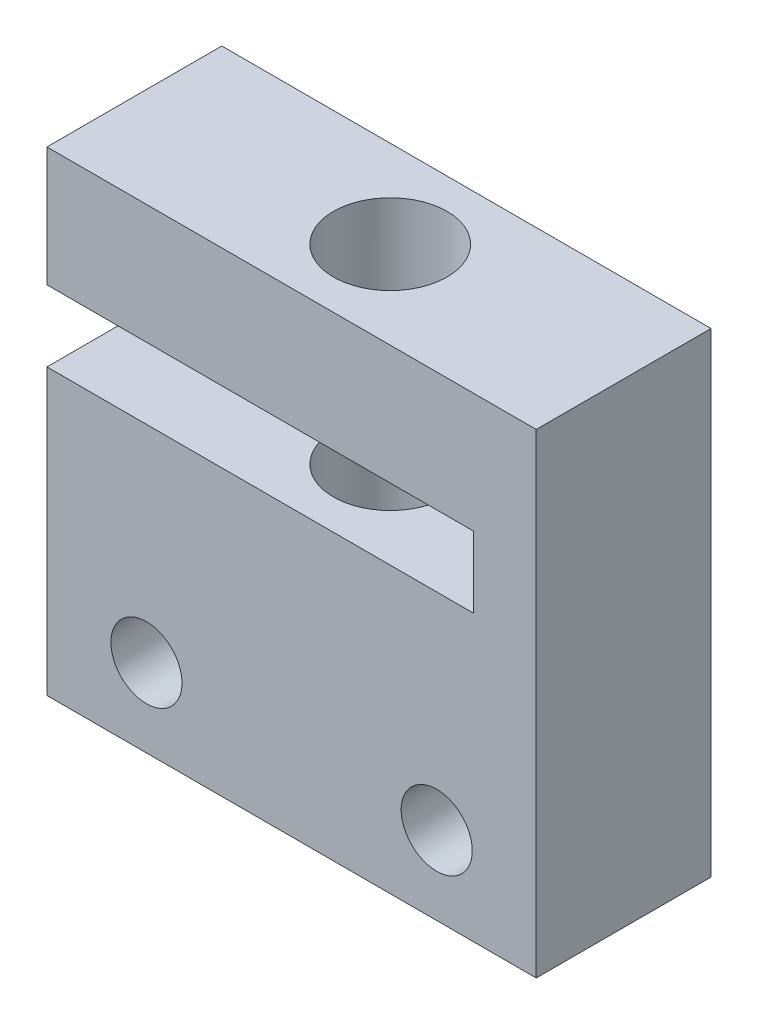
ISO-10303-21;
HEADER;
FILE_DESCRIPTION(('STEP AP214'),'2;1');
FILE_NAME('part.step','',(''),(''),'','','');
FILE_SCHEMA(('AUTOMOTIVE_DESIGN { 1 0 10303 214 1 1 1 1 }'));
ENDSEC;
DATA;
#1=APPLICATION_CONTEXT('core data for automotive mechanical design processes');
#2=APPLICATION_PROTOCOL_DEFINITION('international standard','automotive_design',2000,#1);
#3=PRODUCT_CONTEXT('',#1,'mechanical');
#4=PRODUCT('Part','Part','',(#3));
#5=PRODUCT_RELATED_PRODUCT_CATEGORY('part','',(#4));
#6=PRODUCT_DEFINITION_FORMATION('','',#4);
#7=PRODUCT_DEFINITION_CONTEXT('part definition',#1,'design');
#8=PRODUCT_DEFINITION('design','',#6,#7);
#9=PRODUCT_DEFINITION_SHAPE('','',#8);
#10=(LENGTH_UNIT() NAMED_UNIT(*) SI_UNIT(.MILLI.,.METRE.));
#11=(NAMED_UNIT(*) PLANE_ANGLE_UNIT() SI_UNIT($,.RADIAN.));
#12=(NAMED_UNIT(*) SI_UNIT($,.STERADIAN.) SOLID_ANGLE_UNIT());
#13=UNCERTAINTY_MEASURE_WITH_UNIT(LENGTH_MEASURE(1.E-05),#10,'distance_accuracy_value','');
#14=(GEOMETRIC_REPRESENTATION_CONTEXT(3) GLOBAL_UNCERTAINTY_ASSIGNED_CONTEXT((#13)) GLOBAL_UNIT_ASSIGNED_CONTEXT((#10,
#11,#12)) REPRESENTATION_CONTEXT('',''));
#15=CARTESIAN_POINT('',(0.,0.,0.));
#16=DIRECTION('',(0.,0.,1.));
#17=DIRECTION('',(1.,0.,0.));
#18=AXIS2_PLACEMENT_3D('',#15,#16,#17);
#19=CARTESIAN_POINT('',(0.,0.,12.3));
#20=DIRECTION('',(0.,0.,1.));
#21=DIRECTION('',(1.,0.,0.));
#22=AXIS2_PLACEMENT_3D('',#19,#20,#21);
#23=PLANE('',#22);
#24=CARTESIAN_POINT('',(27.42,5.5,12.3));
#25=DIRECTION('',(0.,0.,1.));
#26=DIRECTION('',(1.,0.,0.));
#27=AXIS2_PLACEMENT_3D('',#24,#25,#26);
#28=CIRCLE('',#27,2.5);
#29=CARTESIAN_POINT('',(29.92,5.5,12.3));
#30=VERTEX_POINT('',#29);
#31=EDGE_CURVE('E139',#30,#30,#28,.T.);
#32=ORIENTED_EDGE('',*,*,#31,.F.);
#33=EDGE_LOOP('',(#32));
#34=FACE_BOUND('',#33,.T.);
#35=DIRECTION('',(0.,1.,0.));
#36=VECTOR('',#35,1.);
#37=CARTESIAN_POINT('',(34.42,33.42,12.3));
#38=LINE('',#37,#36);
#39=CARTESIAN_POINT('',(34.42,0.,12.3));
#40=VERTEX_POINT('',#39);
#41=CARTESIAN_POINT('',(34.42,33.42,12.3));
#42=VERTEX_POINT('',#41);
#43=EDGE_CURVE('E150',#40,#42,#38,.T.);
#44=ORIENTED_EDGE('',*,*,#43,.T.);
#45=DIRECTION('',(-1.,0.,0.));
#46=VECTOR('',#45,1.);
#47=CARTESIAN_POINT('',(0.,33.42,12.3));
#48=LINE('',#47,#46);
#49=CARTESIAN_POINT('',(0.,33.42,12.3));
#50=VERTEX_POINT('',#49);
#51=EDGE_CURVE('E98',#42,#50,#48,.T.);
#52=ORIENTED_EDGE('',*,*,#51,.T.);
#53=DIRECTION('',(0.,-1.,0.));
#54=VECTOR('',#53,1.);
#55=CARTESIAN_POINT('',(0.,33.42,12.3));
#56=LINE('',#55,#54);
#57=CARTESIAN_POINT('',(0.,25.02,12.3));
#58=VERTEX_POINT('',#57);
#59=EDGE_CURVE('E165',#50,#58,#56,.T.);
#60=ORIENTED_EDGE('',*,*,#59,.T.);
#61=DIRECTION('',(1.,0.,0.));
#62=VECTOR('',#61,1.);
#63=CARTESIAN_POINT('',(0.,25.02,12.3));
#64=LINE('',#63,#62);
#65=CARTESIAN_POINT('',(30.,25.02,12.3));
#66=VERTEX_POINT('',#65);
#67=EDGE_CURVE('E178',#58,#66,#64,.T.);
#68=ORIENTED_EDGE('',*,*,#67,.T.);
#69=DIRECTION('',(0.,-1.,0.));
#70=VECTOR('',#69,1.);
#71=CARTESIAN_POINT('',(30.,25.02,12.3));
#72=LINE('',#71,#70);
#73=CARTESIAN_POINT('',(30.,20.02,12.3));
#74=VERTEX_POINT('',#73);
#75=EDGE_CURVE('E117',#66,#74,#72,.T.);
#76=ORIENTED_EDGE('',*,*,#75,.T.);
#77=DIRECTION('',(-1.,0.,0.));
#78=VECTOR('',#77,1.);
#79=CARTESIAN_POINT('',(30.,20.02,12.3));
#80=LINE('',#79,#78);
#81=CARTESIAN_POINT('',(0.,20.02,12.3));
#82=VERTEX_POINT('',#81);
#83=EDGE_CURVE('E111',#74,#82,#80,.T.);
#84=ORIENTED_EDGE('',*,*,#83,.T.);
#85=DIRECTION('',(0.,-1.,0.));
#86=VECTOR('',#85,1.);
#87=CARTESIAN_POINT('',(0.,20.02,12.3));
#88=LINE('',#87,#86);
#89=CARTESIAN_POINT('',(0.,0.,12.3));
#90=VERTEX_POINT('',#89);
#91=EDGE_CURVE('E115',#82,#90,#88,.T.);
#92=ORIENTED_EDGE('',*,*,#91,.T.);
#93=DIRECTION('',(1.,0.,0.));
#94=VECTOR('',#93,1.);
#95=CARTESIAN_POINT('',(0.,0.,12.3));
#96=LINE('',#95,#94);
#97=EDGE_CURVE('E55',#90,#40,#96,.T.);
#98=ORIENTED_EDGE('',*,*,#97,.T.);
#99=EDGE_LOOP('',(#44,#52,#60,#68,#76,#84,#92,#98));
#100=FACE_BOUND('',#99,.T.);
#101=CARTESIAN_POINT('',(7.00000000000001,5.5,12.3));
#102=DIRECTION('',(0.,0.,1.));
#103=DIRECTION('',(-1.,0.,0.));
#104=AXIS2_PLACEMENT_3D('',#101,#102,#103);
#105=CIRCLE('',#104,2.5);
#106=CARTESIAN_POINT('',(4.50000000000001,5.5,12.3));
#107=VERTEX_POINT('',#106);
#108=EDGE_CURVE('E187',#107,#107,#105,.T.);
#109=ORIENTED_EDGE('',*,*,#108,.F.);
#110=EDGE_LOOP('',(#109));
#111=FACE_BOUND('',#110,.T.);
#112=ADVANCED_FACE('F38',(#34,#100,#111),#23,.T.);
#113=CARTESIAN_POINT('',(0.,0.,0.));
#114=DIRECTION('',(0.,0.,1.));
#115=DIRECTION('',(1.,0.,0.));
#116=AXIS2_PLACEMENT_3D('',#113,#114,#115);
#117=PLANE('',#116);
#118=DIRECTION('',(0.,1.,0.));
#119=VECTOR('',#118,1.);
#120=CARTESIAN_POINT('',(34.42,33.42,0.));
#121=LINE('',#120,#119);
#122=CARTESIAN_POINT('',(34.42,0.,0.));
#123=VERTEX_POINT('',#122);
#124=CARTESIAN_POINT('',(34.42,33.42,0.));
#125=VERTEX_POINT('',#124);
#126=EDGE_CURVE('E135',#123,#125,#121,.T.);
#127=ORIENTED_EDGE('',*,*,#126,.F.);
#128=DIRECTION('',(1.,0.,0.));
#129=VECTOR('',#128,1.);
#130=CARTESIAN_POINT('',(0.,0.,0.));
#131=LINE('',#130,#129);
#132=CARTESIAN_POINT('',(0.,0.,0.));
#133=VERTEX_POINT('',#132);
#134=EDGE_CURVE('E90',#133,#123,#131,.T.);
#135=ORIENTED_EDGE('',*,*,#134,.F.);
#136=DIRECTION('',(0.,-1.,0.));
#137=VECTOR('',#136,1.);
#138=CARTESIAN_POINT('',(0.,20.02,0.));
#139=LINE('',#138,#137);
#140=CARTESIAN_POINT('',(0.,20.02,0.));
#141=VERTEX_POINT('',#140);
#142=EDGE_CURVE('E84',#141,#133,#139,.T.);
#143=ORIENTED_EDGE('',*,*,#142,.F.);
#144=DIRECTION('',(-1.,0.,0.));
#145=VECTOR('',#144,1.);
#146=CARTESIAN_POINT('',(30.,20.02,0.));
#147=LINE('',#146,#145);
#148=CARTESIAN_POINT('',(30.,20.02,0.));
#149=VERTEX_POINT('',#148);
#150=EDGE_CURVE('E125',#149,#141,#147,.T.);
#151=ORIENTED_EDGE('',*,*,#150,.F.);
#152=DIRECTION('',(0.,-1.,0.));
#153=VECTOR('',#152,1.);
#154=CARTESIAN_POINT('',(30.,25.02,0.));
#155=LINE('',#154,#153);
#156=CARTESIAN_POINT('',(30.,25.02,0.));
#157=VERTEX_POINT('',#156);
#158=EDGE_CURVE('E145',#157,#149,#155,.T.);
#159=ORIENTED_EDGE('',*,*,#158,.F.);
#160=DIRECTION('',(1.,0.,0.));
#161=VECTOR('',#160,1.);
#162=CARTESIAN_POINT('',(0.,25.02,0.));
#163=LINE('',#162,#161);
#164=CARTESIAN_POINT('',(0.,25.02,0.));
#165=VERTEX_POINT('',#164);
#166=EDGE_CURVE('E143',#165,#157,#163,.T.);
#167=ORIENTED_EDGE('',*,*,#166,.F.);
#168=DIRECTION('',(0.,-1.,0.));
#169=VECTOR('',#168,1.);
#170=CARTESIAN_POINT('',(0.,33.42,0.));
#171=LINE('',#170,#169);
#172=CARTESIAN_POINT('',(0.,33.42,0.));
#173=VERTEX_POINT('',#172);
#174=EDGE_CURVE('E141',#173,#165,#171,.T.);
#175=ORIENTED_EDGE('',*,*,#174,.F.);
#176=DIRECTION('',(-1.,0.,0.));
#177=VECTOR('',#176,1.);
#178=CARTESIAN_POINT('',(0.,33.42,0.));
#179=LINE('',#178,#177);
#180=EDGE_CURVE('E138',#125,#173,#179,.T.);
#181=ORIENTED_EDGE('',*,*,#180,.F.);
#182=EDGE_LOOP('',(#127,#135,#143,#151,#159,#167,#175,#181));
#183=FACE_BOUND('',#182,.T.);
#184=CARTESIAN_POINT('',(27.42,5.5,0.));
#185=DIRECTION('',(0.,0.,1.));
#186=DIRECTION('',(1.,0.,0.));
#187=AXIS2_PLACEMENT_3D('',#184,#185,#186);
#188=CIRCLE('',#187,2.5);
#189=CARTESIAN_POINT('',(29.92,5.5,0.));
#190=VERTEX_POINT('',#189);
#191=EDGE_CURVE('E184',#190,#190,#188,.T.);
#192=ORIENTED_EDGE('',*,*,#191,.T.);
#193=EDGE_LOOP('',(#192));
#194=FACE_BOUND('',#193,.T.);
#195=CARTESIAN_POINT('',(7.00000000000001,5.5,0.));
#196=DIRECTION('',(0.,0.,1.));
#197=DIRECTION('',(-1.,0.,0.));
#198=AXIS2_PLACEMENT_3D('',#195,#196,#197);
#199=CIRCLE('',#198,2.5);
#200=CARTESIAN_POINT('',(4.50000000000001,5.5,0.));
#201=VERTEX_POINT('',#200);
#202=EDGE_CURVE('E190',#201,#201,#199,.T.);
#203=ORIENTED_EDGE('',*,*,#202,.T.);
#204=EDGE_LOOP('',(#203));
#205=FACE_BOUND('',#204,.T.);
#206=ADVANCED_FACE('F169',(#183,#194,#205),#117,.F.);
#207=CARTESIAN_POINT('',(34.42,33.42,12.3));
#208=DIRECTION('',(-1.,0.,0.));
#209=DIRECTION('',(0.,-1.,0.));
#210=AXIS2_PLACEMENT_3D('',#207,#208,#209);
#211=PLANE('',#210);
#212=ORIENTED_EDGE('',*,*,#126,.T.);
#213=DIRECTION('',(0.,0.,-1.));
#214=VECTOR('',#213,1.);
#215=CARTESIAN_POINT('',(34.42,33.42,12.3));
#216=LINE('',#215,#214);
#217=EDGE_CURVE('E11',#42,#125,#216,.T.);
#218=ORIENTED_EDGE('',*,*,#217,.F.);
#219=ORIENTED_EDGE('',*,*,#43,.F.);
#220=DIRECTION('',(0.,0.,-1.));
#221=VECTOR('',#220,1.);
#222=CARTESIAN_POINT('',(34.42,0.,12.3));
#223=LINE('',#222,#221);
#224=EDGE_CURVE('E131',#40,#123,#223,.T.);
#225=ORIENTED_EDGE('',*,*,#224,.T.);
#226=EDGE_LOOP('',(#212,#218,#219,#225));
#227=FACE_BOUND('',#226,.T.);
#228=ADVANCED_FACE('F40',(#227),#211,.F.);
#229=CARTESIAN_POINT('',(0.,33.42,12.3));
#230=DIRECTION('',(0.,-1.,0.));
#231=DIRECTION('',(0.,0.,-1.));
#232=AXIS2_PLACEMENT_3D('',#229,#230,#231);
#233=PLANE('',#232);
#234=CARTESIAN_POINT('',(18.,33.42,6.15));
#235=DIRECTION('',(0.,-1.,0.));
#236=DIRECTION('',(0.,0.,-1.));
#237=AXIS2_PLACEMENT_3D('',#234,#235,#236);
#238=CIRCLE('',#237,4.);
#239=CARTESIAN_POINT('',(18.,33.42,2.15));
#240=VERTEX_POINT('',#239);
#241=EDGE_CURVE('E201',#240,#240,#238,.T.);
#242=ORIENTED_EDGE('',*,*,#241,.T.);
#243=EDGE_LOOP('',(#242));
#244=FACE_BOUND('',#243,.T.);
#245=ORIENTED_EDGE('',*,*,#180,.T.);
#246=DIRECTION('',(0.,0.,-1.));
#247=VECTOR('',#246,1.);
#248=CARTESIAN_POINT('',(0.,33.42,12.3));
#249=LINE('',#248,#247);
#250=EDGE_CURVE('E47',#50,#173,#249,.T.);
#251=ORIENTED_EDGE('',*,*,#250,.F.);
#252=ORIENTED_EDGE('',*,*,#51,.F.);
#253=ORIENTED_EDGE('',*,*,#217,.T.);
#254=EDGE_LOOP('',(#245,#251,#252,#253));
#255=FACE_BOUND('',#254,.T.);
#256=ADVANCED_FACE('F208',(#244,#255),#233,.F.);
#257=CARTESIAN_POINT('',(0.,33.42,12.3));
#258=DIRECTION('',(1.,0.,0.));
#259=DIRECTION('',(0.,0.,-1.));
#260=AXIS2_PLACEMENT_3D('',#257,#258,#259);
#261=PLANE('',#260);
#262=ORIENTED_EDGE('',*,*,#174,.T.);
#263=DIRECTION('',(0.,0.,-1.));
#264=VECTOR('',#263,1.);
#265=CARTESIAN_POINT('',(0.,25.02,12.3));
#266=LINE('',#265,#264);
#267=EDGE_CURVE('E157',#58,#165,#266,.T.);
#268=ORIENTED_EDGE('',*,*,#267,.F.);
#269=ORIENTED_EDGE('',*,*,#59,.F.);
#270=ORIENTED_EDGE('',*,*,#250,.T.);
#271=EDGE_LOOP('',(#262,#268,#269,#270));
#272=FACE_BOUND('',#271,.T.);
#273=ADVANCED_FACE('F163',(#272),#261,.F.);
#274=CARTESIAN_POINT('',(0.,25.02,12.3));
#275=DIRECTION('',(0.,1.,0.));
#276=DIRECTION('',(0.,0.,1.));
#277=AXIS2_PLACEMENT_3D('',#274,#275,#276);
#278=PLANE('',#277);
#279=CARTESIAN_POINT('',(18.,25.02,6.15));
#280=DIRECTION('',(0.,1.,0.));
#281=DIRECTION('',(0.,0.,1.));
#282=AXIS2_PLACEMENT_3D('',#279,#280,#281);
#283=CIRCLE('',#282,4.);
#284=CARTESIAN_POINT('',(18.,25.02,10.15));
#285=VERTEX_POINT('',#284);
#286=EDGE_CURVE('E193',#285,#285,#283,.T.);
#287=ORIENTED_EDGE('',*,*,#286,.T.);
#288=EDGE_LOOP('',(#287));
#289=FACE_BOUND('',#288,.T.);
#290=ORIENTED_EDGE('',*,*,#166,.T.);
#291=DIRECTION('',(0.,0.,-1.));
#292=VECTOR('',#291,1.);
#293=CARTESIAN_POINT('',(30.,25.02,12.3));
#294=LINE('',#293,#292);
#295=EDGE_CURVE('E154',#66,#157,#294,.T.);
#296=ORIENTED_EDGE('',*,*,#295,.F.);
#297=ORIENTED_EDGE('',*,*,#67,.F.);
#298=ORIENTED_EDGE('',*,*,#267,.T.);
#299=EDGE_LOOP('',(#290,#296,#297,#298));
#300=FACE_BOUND('',#299,.T.);
#301=ADVANCED_FACE('F174',(#289,#300),#278,.F.);
#302=CARTESIAN_POINT('',(30.,25.02,12.3));
#303=DIRECTION('',(1.,0.,0.));
#304=DIRECTION('',(0.,1.,0.));
#305=AXIS2_PLACEMENT_3D('',#302,#303,#304);
#306=PLANE('',#305);
#307=ORIENTED_EDGE('',*,*,#158,.T.);
#308=DIRECTION('',(0.,0.,-1.));
#309=VECTOR('',#308,1.);
#310=CARTESIAN_POINT('',(30.,20.02,12.3));
#311=LINE('',#310,#309);
#312=EDGE_CURVE('E126',#74,#149,#311,.T.);
#313=ORIENTED_EDGE('',*,*,#312,.F.);
#314=ORIENTED_EDGE('',*,*,#75,.F.);
#315=ORIENTED_EDGE('',*,*,#295,.T.);
#316=EDGE_LOOP('',(#307,#313,#314,#315));
#317=FACE_BOUND('',#316,.T.);
#318=ADVANCED_FACE('F177',(#317),#306,.F.);
#319=CARTESIAN_POINT('',(30.,20.02,12.3));
#320=DIRECTION('',(0.,-1.,0.));
#321=DIRECTION('',(0.,0.,-1.));
#322=AXIS2_PLACEMENT_3D('',#319,#320,#321);
#323=PLANE('',#322);
#324=CARTESIAN_POINT('',(18.,20.02,6.15));
#325=DIRECTION('',(0.,-1.,0.));
#326=DIRECTION('',(0.,0.,-1.));
#327=AXIS2_PLACEMENT_3D('',#324,#325,#326);
#328=CIRCLE('',#327,4.);
#329=CARTESIAN_POINT('',(18.,20.02,2.15));
#330=VERTEX_POINT('',#329);
#331=EDGE_CURVE('E198',#330,#330,#328,.T.);
#332=ORIENTED_EDGE('',*,*,#331,.T.);
#333=EDGE_LOOP('',(#332));
#334=FACE_BOUND('',#333,.T.);
#335=ORIENTED_EDGE('',*,*,#150,.T.);
#336=DIRECTION('',(0.,0.,-1.));
#337=VECTOR('',#336,1.);
#338=CARTESIAN_POINT('',(0.,20.02,12.3));
#339=LINE('',#338,#337);
#340=EDGE_CURVE('E122',#82,#141,#339,.T.);
#341=ORIENTED_EDGE('',*,*,#340,.F.);
#342=ORIENTED_EDGE('',*,*,#83,.F.);
#343=ORIENTED_EDGE('',*,*,#312,.T.);
#344=EDGE_LOOP('',(#335,#341,#342,#343));
#345=FACE_BOUND('',#344,.T.);
#346=ADVANCED_FACE('F123',(#334,#345),#323,.F.);
#347=CARTESIAN_POINT('',(0.,20.02,12.3));
#348=DIRECTION('',(1.,0.,0.));
#349=DIRECTION('',(0.,0.,-1.));
#350=AXIS2_PLACEMENT_3D('',#347,#348,#349);
#351=PLANE('',#350);
#352=ORIENTED_EDGE('',*,*,#142,.T.);
#353=DIRECTION('',(0.,0.,-1.));
#354=VECTOR('',#353,1.);
#355=CARTESIAN_POINT('',(0.,0.,12.3));
#356=LINE('',#355,#354);
#357=EDGE_CURVE('E127',#90,#133,#356,.T.);
#358=ORIENTED_EDGE('',*,*,#357,.F.);
#359=ORIENTED_EDGE('',*,*,#91,.F.);
#360=ORIENTED_EDGE('',*,*,#340,.T.);
#361=EDGE_LOOP('',(#352,#358,#359,#360));
#362=FACE_BOUND('',#361,.T.);
#363=ADVANCED_FACE('F129',(#362),#351,.F.);
#364=CARTESIAN_POINT('',(0.,0.,12.3));
#365=DIRECTION('',(0.,1.,0.));
#366=DIRECTION('',(0.,0.,1.));
#367=AXIS2_PLACEMENT_3D('',#364,#365,#366);
#368=PLANE('',#367);
#369=CARTESIAN_POINT('',(18.,0.,6.15));
#370=DIRECTION('',(0.,-1.,0.));
#371=DIRECTION('',(0.,0.,-1.));
#372=AXIS2_PLACEMENT_3D('',#369,#370,#371);
#373=CIRCLE('',#372,4.);
#374=CARTESIAN_POINT('',(18.,0.,2.15));
#375=VERTEX_POINT('',#374);
#376=EDGE_CURVE('E202',#375,#375,#373,.T.);
#377=ORIENTED_EDGE('',*,*,#376,.F.);
#378=EDGE_LOOP('',(#377));
#379=FACE_BOUND('',#378,.T.);
#380=ORIENTED_EDGE('',*,*,#134,.T.);
#381=ORIENTED_EDGE('',*,*,#224,.F.);
#382=ORIENTED_EDGE('',*,*,#97,.F.);
#383=ORIENTED_EDGE('',*,*,#357,.T.);
#384=EDGE_LOOP('',(#380,#381,#382,#383));
#385=FACE_BOUND('',#384,.T.);
#386=ADVANCED_FACE('F237',(#379,#385),#368,.F.);
#387=CARTESIAN_POINT('',(27.42,5.5,12.3));
#388=DIRECTION('',(0.,0.,-1.));
#389=DIRECTION('',(-1.,0.,0.));
#390=AXIS2_PLACEMENT_3D('',#387,#388,#389);
#391=CYLINDRICAL_SURFACE('',#390,2.5);
#392=ORIENTED_EDGE('',*,*,#31,.T.);
#393=EDGE_LOOP('',(#392));
#394=FACE_BOUND('',#393,.T.);
#395=ORIENTED_EDGE('',*,*,#191,.F.);
#396=EDGE_LOOP('',(#395));
#397=FACE_BOUND('',#396,.T.);
#398=ADVANCED_FACE('F234',(#394,#397),#391,.F.);
#399=CARTESIAN_POINT('',(7.00000000000001,5.5,12.3));
#400=DIRECTION('',(0.,0.,-1.));
#401=DIRECTION('',(-1.,0.,0.));
#402=AXIS2_PLACEMENT_3D('',#399,#400,#401);
#403=CYLINDRICAL_SURFACE('',#402,2.5);
#404=ORIENTED_EDGE('',*,*,#108,.T.);
#405=EDGE_LOOP('',(#404));
#406=FACE_BOUND('',#405,.T.);
#407=ORIENTED_EDGE('',*,*,#202,.F.);
#408=EDGE_LOOP('',(#407));
#409=FACE_BOUND('',#408,.T.);
#410=ADVANCED_FACE('F250',(#406,#409),#403,.F.);
#411=CARTESIAN_POINT('',(18.,33.42,6.15));
#412=DIRECTION('',(0.,-1.,0.));
#413=DIRECTION('',(0.,0.,-1.));
#414=AXIS2_PLACEMENT_3D('',#411,#412,#413);
#415=CYLINDRICAL_SURFACE('',#414,4.);
#416=ORIENTED_EDGE('',*,*,#376,.T.);
#417=EDGE_LOOP('',(#416));
#418=FACE_BOUND('',#417,.T.);
#419=ORIENTED_EDGE('',*,*,#331,.F.);
#420=EDGE_LOOP('',(#419));
#421=FACE_BOUND('',#420,.T.);
#422=ADVANCED_FACE('F213',(#418,#421),#415,.F.);
#423=ORIENTED_EDGE('',*,*,#241,.F.);
#424=EDGE_LOOP('',(#423));
#425=FACE_BOUND('',#424,.T.);
#426=ORIENTED_EDGE('',*,*,#286,.F.);
#427=EDGE_LOOP('',(#426));
#428=FACE_BOUND('',#427,.T.);
#429=ADVANCED_FACE('F210',(#425,#428),#415,.F.);
#430=CLOSED_SHELL('',(#112,#206,#228,#256,#273,#301,#318,#346,#363,#386,#398,#410,#422,#429));
#431=MANIFOLD_SOLID_BREP('B2',#430);
#432=ADVANCED_BREP_SHAPE_REPRESENTATION('',(#18,#431),#14);
#433=SHAPE_DEFINITION_REPRESENTATION(#9,#432);
ENDSEC;
END-ISO-10303-21;
